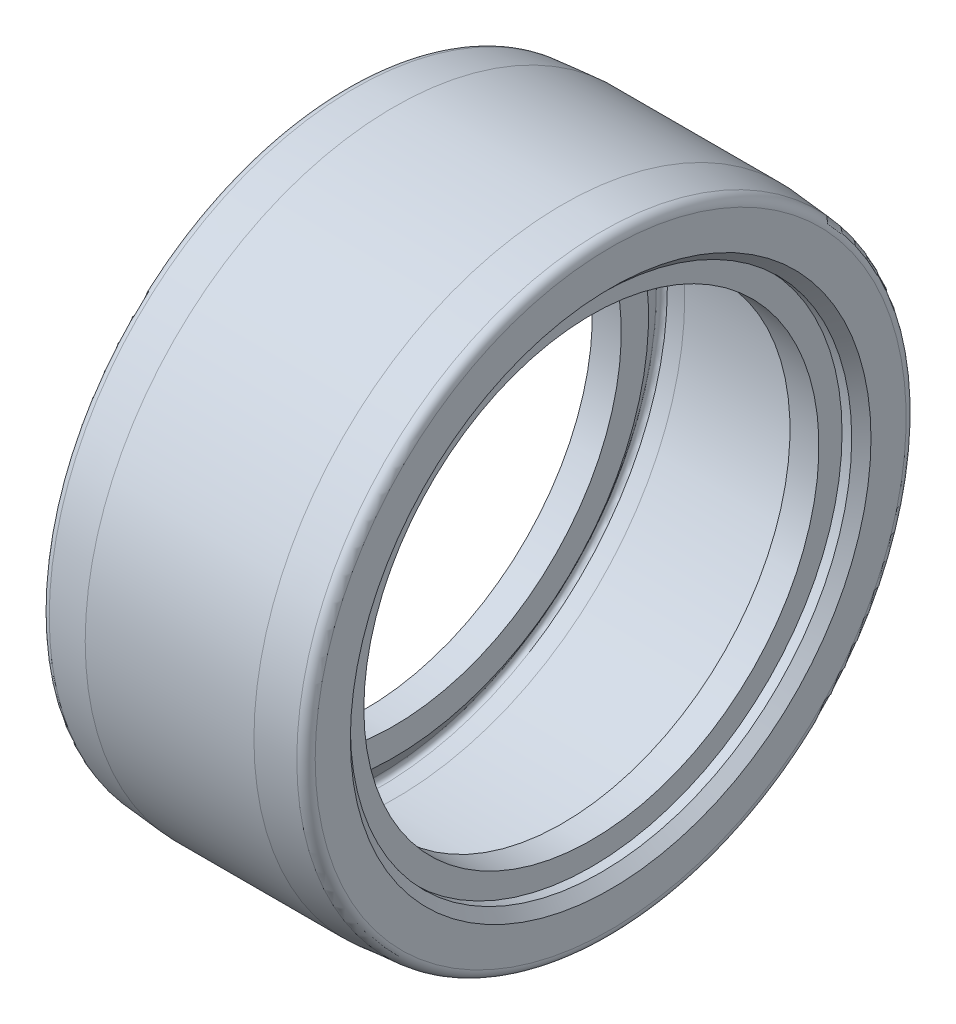
ISO-10303-21;
HEADER;
FILE_DESCRIPTION(('STEP AP214'),'2;1');
FILE_NAME('part.step','',(''),(''),'','','');
FILE_SCHEMA(('AUTOMOTIVE_DESIGN { 1 0 10303 214 1 1 1 1 }'));
ENDSEC;
DATA;
#1=APPLICATION_CONTEXT('core data for automotive mechanical design processes');
#2=APPLICATION_PROTOCOL_DEFINITION('international standard','automotive_design',2000,#1);
#3=PRODUCT_CONTEXT('',#1,'mechanical');
#4=PRODUCT('Part','Part','',(#3));
#5=PRODUCT_RELATED_PRODUCT_CATEGORY('part','',(#4));
#6=PRODUCT_DEFINITION_FORMATION('','',#4);
#7=PRODUCT_DEFINITION_CONTEXT('part definition',#1,'design');
#8=PRODUCT_DEFINITION('design','',#6,#7);
#9=PRODUCT_DEFINITION_SHAPE('','',#8);
#10=(LENGTH_UNIT() NAMED_UNIT(*) SI_UNIT(.MILLI.,.METRE.));
#11=(NAMED_UNIT(*) PLANE_ANGLE_UNIT() SI_UNIT($,.RADIAN.));
#12=(NAMED_UNIT(*) SI_UNIT($,.STERADIAN.) SOLID_ANGLE_UNIT());
#13=UNCERTAINTY_MEASURE_WITH_UNIT(LENGTH_MEASURE(1.E-05),#10,'distance_accuracy_value','');
#14=(GEOMETRIC_REPRESENTATION_CONTEXT(3) GLOBAL_UNCERTAINTY_ASSIGNED_CONTEXT((#13)) GLOBAL_UNIT_ASSIGNED_CONTEXT((#10,
#11,#12)) REPRESENTATION_CONTEXT('',''));
#15=CARTESIAN_POINT('',(0.,0.,0.));
#16=DIRECTION('',(0.,0.,1.));
#17=DIRECTION('',(1.,0.,0.));
#18=AXIS2_PLACEMENT_3D('',#15,#16,#17);
#19=CARTESIAN_POINT('',(2.5,23.6,0.));
#20=DIRECTION('',(-1.,0.,0.));
#21=DIRECTION('',(0.,0.,1.));
#22=AXIS2_PLACEMENT_3D('',#19,#20,#21);
#23=PLANE('',#22);
#24=CARTESIAN_POINT('',(2.5,0.,0.));
#25=DIRECTION('',(-1.,0.,0.));
#26=DIRECTION('',(0.,0.,1.));
#27=AXIS2_PLACEMENT_3D('',#24,#25,#26);
#28=CIRCLE('',#27,26.4296299831447);
#29=CARTESIAN_POINT('',(2.5,0.,26.4296299831447));
#30=VERTEX_POINT('',#29);
#31=EDGE_CURVE('E10',#30,#30,#28,.T.);
#32=ORIENTED_EDGE('',*,*,#31,.F.);
#33=EDGE_LOOP('',(#32));
#34=FACE_BOUND('',#33,.T.);
#35=CARTESIAN_POINT('',(2.5,0.,0.));
#36=DIRECTION('',(-1.,0.,0.));
#37=DIRECTION('',(0.,0.,1.));
#38=AXIS2_PLACEMENT_3D('',#35,#36,#37);
#39=CIRCLE('',#38,23.6);
#40=CARTESIAN_POINT('',(2.5,0.,23.6));
#41=VERTEX_POINT('',#40);
#42=EDGE_CURVE('E104',#41,#41,#39,.T.);
#43=ORIENTED_EDGE('',*,*,#42,.T.);
#44=EDGE_LOOP('',(#43));
#45=FACE_BOUND('',#44,.T.);
#46=ADVANCED_FACE('F28',(#34,#45),#23,.F.);
#47=CARTESIAN_POINT('',(2.5,0.,0.));
#48=DIRECTION('',(-1.,0.,0.));
#49=DIRECTION('',(0.,0.,1.));
#50=AXIS2_PLACEMENT_3D('',#47,#48,#49);
#51=CONICAL_SURFACE('',#50,26.4296299831447,0.959931088596876);
#52=CARTESIAN_POINT('',(0.646082422831486,0.,0.));
#53=DIRECTION('',(-1.,0.,0.));
#54=DIRECTION('',(0.,0.,1.));
#55=AXIS2_PLACEMENT_3D('',#52,#53,#54);
#56=CIRCLE('',#55,29.0772986756421);
#57=CARTESIAN_POINT('',(0.646082422831486,0.,29.0772986756421));
#58=VERTEX_POINT('',#57);
#59=EDGE_CURVE('E34',#58,#58,#56,.T.);
#60=ORIENTED_EDGE('',*,*,#59,.F.);
#61=EDGE_LOOP('',(#60));
#62=FACE_BOUND('',#61,.T.);
#63=ORIENTED_EDGE('',*,*,#31,.T.);
#64=EDGE_LOOP('',(#63));
#65=FACE_BOUND('',#64,.T.);
#66=ADVANCED_FACE('F237',(#62,#65),#51,.T.);
#67=CARTESIAN_POINT('',(1.05565844497598,0.,0.));
#68=DIRECTION('',(-1.,0.,0.));
#69=DIRECTION('',(0.,0.,1.));
#70=AXIS2_PLACEMENT_3D('',#67,#68,#69);
#71=TOROIDAL_SURFACE('',#70,29.3640868938176,0.5);
#72=CARTESIAN_POINT('',(1.01208057360216,0.,0.));
#73=DIRECTION('',(-1.,0.,0.));
#74=DIRECTION('',(0.,0.,1.));
#75=AXIS2_PLACEMENT_3D('',#72,#73,#74);
#76=CIRCLE('',#75,29.8621842428635);
#77=CARTESIAN_POINT('',(1.01208057360216,0.,29.8621842428635));
#78=VERTEX_POINT('',#77);
#79=EDGE_CURVE('E38',#78,#78,#76,.T.);
#80=ORIENTED_EDGE('',*,*,#79,.F.);
#81=EDGE_LOOP('',(#80));
#82=FACE_BOUND('',#81,.T.);
#83=ORIENTED_EDGE('',*,*,#59,.T.);
#84=EDGE_LOOP('',(#83));
#85=FACE_BOUND('',#84,.T.);
#86=ADVANCED_FACE('F232',(#82,#85),#71,.F.);
#87=CARTESIAN_POINT('',(1.01208057360216,0.,0.));
#88=DIRECTION('',(1.,0.,0.));
#89=DIRECTION('',(0.,0.,-1.));
#90=AXIS2_PLACEMENT_3D('',#87,#88,#89);
#91=CONICAL_SURFACE('',#90,29.8621842428635,0.0872664625997093);
#92=CARTESIAN_POINT('',(2.6743114854953,0.,0.));
#93=DIRECTION('',(-1.,0.,0.));
#94=DIRECTION('',(0.,0.,1.));
#95=AXIS2_PLACEMENT_3D('',#92,#93,#94);
#96=CIRCLE('',#95,30.0076106038165);
#97=CARTESIAN_POINT('',(2.6743114854953,0.,30.0076106038165));
#98=VERTEX_POINT('',#97);
#99=EDGE_CURVE('E42',#98,#98,#96,.T.);
#100=ORIENTED_EDGE('',*,*,#99,.F.);
#101=EDGE_LOOP('',(#100));
#102=FACE_BOUND('',#101,.T.);
#103=ORIENTED_EDGE('',*,*,#79,.T.);
#104=EDGE_LOOP('',(#103));
#105=FACE_BOUND('',#104,.T.);
#106=ADVANCED_FACE('F226',(#102,#105),#91,.F.);
#107=CARTESIAN_POINT('',(10.,0.,0.));
#108=DIRECTION('',(-1.,0.,0.));
#109=DIRECTION('',(0.,0.,1.));
#110=AXIS2_PLACEMENT_3D('',#107,#108,#109);
#111=CYLINDRICAL_SURFACE('',#110,30.0076106038165);
#112=CARTESIAN_POINT('',(19.8256885145047,0.,0.));
#113=DIRECTION('',(-1.,0.,0.));
#114=DIRECTION('',(0.,0.,1.));
#115=AXIS2_PLACEMENT_3D('',#112,#113,#114);
#116=CIRCLE('',#115,30.0076106038165);
#117=CARTESIAN_POINT('',(19.8256885145047,0.,30.0076106038165));
#118=VERTEX_POINT('',#117);
#119=EDGE_CURVE('E47',#118,#118,#116,.T.);
#120=ORIENTED_EDGE('',*,*,#119,.F.);
#121=EDGE_LOOP('',(#120));
#122=FACE_BOUND('',#121,.T.);
#123=ORIENTED_EDGE('',*,*,#99,.T.);
#124=EDGE_LOOP('',(#123));
#125=FACE_BOUND('',#124,.T.);
#126=ADVANCED_FACE('F220',(#122,#125),#111,.F.);
#127=CARTESIAN_POINT('',(19.8256885145047,0.,0.));
#128=DIRECTION('',(-1.,0.,0.));
#129=DIRECTION('',(0.,0.,1.));
#130=AXIS2_PLACEMENT_3D('',#127,#128,#129);
#131=CONICAL_SURFACE('',#130,30.0076106038165,0.0872664625997073);
#132=CARTESIAN_POINT('',(21.4879194263978,0.,0.));
#133=DIRECTION('',(-1.,0.,0.));
#134=DIRECTION('',(0.,0.,1.));
#135=AXIS2_PLACEMENT_3D('',#132,#133,#134);
#136=CIRCLE('',#135,29.8621842428635);
#137=CARTESIAN_POINT('',(21.4879194263978,0.,29.8621842428635));
#138=VERTEX_POINT('',#137);
#139=EDGE_CURVE('E50',#138,#138,#136,.T.);
#140=ORIENTED_EDGE('',*,*,#139,.F.);
#141=EDGE_LOOP('',(#140));
#142=FACE_BOUND('',#141,.T.);
#143=ORIENTED_EDGE('',*,*,#119,.T.);
#144=EDGE_LOOP('',(#143));
#145=FACE_BOUND('',#144,.T.);
#146=ADVANCED_FACE('F214',(#142,#145),#131,.F.);
#147=CARTESIAN_POINT('',(21.444341555024,0.,0.));
#148=DIRECTION('',(-1.,0.,0.));
#149=DIRECTION('',(0.,0.,1.));
#150=AXIS2_PLACEMENT_3D('',#147,#148,#149);
#151=TOROIDAL_SURFACE('',#150,29.3640868938176,0.500000000000002);
#152=CARTESIAN_POINT('',(21.8539175771685,0.,0.));
#153=DIRECTION('',(-1.,0.,0.));
#154=DIRECTION('',(0.,0.,1.));
#155=AXIS2_PLACEMENT_3D('',#152,#153,#154);
#156=CIRCLE('',#155,29.0772986756421);
#157=CARTESIAN_POINT('',(21.8539175771685,0.,29.0772986756421));
#158=VERTEX_POINT('',#157);
#159=EDGE_CURVE('E53',#158,#158,#156,.T.);
#160=ORIENTED_EDGE('',*,*,#159,.F.);
#161=EDGE_LOOP('',(#160));
#162=FACE_BOUND('',#161,.T.);
#163=ORIENTED_EDGE('',*,*,#139,.T.);
#164=EDGE_LOOP('',(#163));
#165=FACE_BOUND('',#164,.T.);
#166=ADVANCED_FACE('F208',(#162,#165),#151,.F.);
#167=CARTESIAN_POINT('',(21.8539175771685,0.,0.));
#168=DIRECTION('',(1.,0.,0.));
#169=DIRECTION('',(0.,0.,-1.));
#170=AXIS2_PLACEMENT_3D('',#167,#168,#169);
#171=CONICAL_SURFACE('',#170,29.0772986756421,0.959931088596874);
#172=CARTESIAN_POINT('',(20.,0.,0.));
#173=DIRECTION('',(-1.,0.,0.));
#174=DIRECTION('',(0.,0.,1.));
#175=AXIS2_PLACEMENT_3D('',#172,#173,#174);
#176=CIRCLE('',#175,26.4296299831448);
#177=CARTESIAN_POINT('',(20.,0.,26.4296299831448));
#178=VERTEX_POINT('',#177);
#179=EDGE_CURVE('E56',#178,#178,#176,.T.);
#180=ORIENTED_EDGE('',*,*,#179,.F.);
#181=EDGE_LOOP('',(#180));
#182=FACE_BOUND('',#181,.T.);
#183=ORIENTED_EDGE('',*,*,#159,.T.);
#184=EDGE_LOOP('',(#183));
#185=FACE_BOUND('',#184,.T.);
#186=ADVANCED_FACE('F202',(#182,#185),#171,.T.);
#187=CARTESIAN_POINT('',(20.,23.6,0.));
#188=DIRECTION('',(1.,0.,0.));
#189=DIRECTION('',(0.,0.,-1.));
#190=AXIS2_PLACEMENT_3D('',#187,#188,#189);
#191=PLANE('',#190);
#192=CARTESIAN_POINT('',(20.,0.,0.));
#193=DIRECTION('',(-1.,0.,0.));
#194=DIRECTION('',(0.,0.,1.));
#195=AXIS2_PLACEMENT_3D('',#192,#193,#194);
#196=CIRCLE('',#195,23.6);
#197=CARTESIAN_POINT('',(20.,0.,23.6));
#198=VERTEX_POINT('',#197);
#199=EDGE_CURVE('E59',#198,#198,#196,.T.);
#200=ORIENTED_EDGE('',*,*,#199,.F.);
#201=EDGE_LOOP('',(#200));
#202=FACE_BOUND('',#201,.T.);
#203=ORIENTED_EDGE('',*,*,#179,.T.);
#204=EDGE_LOOP('',(#203));
#205=FACE_BOUND('',#204,.T.);
#206=ADVANCED_FACE('F196',(#202,#205),#191,.F.);
#207=CARTESIAN_POINT('',(10.,0.,0.));
#208=DIRECTION('',(-1.,0.,0.));
#209=DIRECTION('',(0.,0.,1.));
#210=AXIS2_PLACEMENT_3D('',#207,#208,#209);
#211=CYLINDRICAL_SURFACE('',#210,23.6);
#212=CARTESIAN_POINT('',(23.,0.,0.));
#213=DIRECTION('',(-1.,0.,0.));
#214=DIRECTION('',(0.,0.,1.));
#215=AXIS2_PLACEMENT_3D('',#212,#213,#214);
#216=CIRCLE('',#215,23.6);
#217=CARTESIAN_POINT('',(23.,0.,23.6));
#218=VERTEX_POINT('',#217);
#219=EDGE_CURVE('E62',#218,#218,#216,.T.);
#220=ORIENTED_EDGE('',*,*,#219,.F.);
#221=EDGE_LOOP('',(#220));
#222=FACE_BOUND('',#221,.T.);
#223=ORIENTED_EDGE('',*,*,#199,.T.);
#224=EDGE_LOOP('',(#223));
#225=FACE_BOUND('',#224,.T.);
#226=ADVANCED_FACE('F190',(#222,#225),#211,.F.);
#227=CARTESIAN_POINT('',(23.,23.6,0.));
#228=DIRECTION('',(-1.,0.,0.));
#229=DIRECTION('',(0.,0.,1.));
#230=AXIS2_PLACEMENT_3D('',#227,#228,#229);
#231=PLANE('',#230);
#232=CARTESIAN_POINT('',(23.,0.,0.));
#233=DIRECTION('',(-1.,0.,0.));
#234=DIRECTION('',(0.,0.,1.));
#235=AXIS2_PLACEMENT_3D('',#232,#233,#234);
#236=CIRCLE('',#235,26.);
#237=CARTESIAN_POINT('',(23.,0.,26.));
#238=VERTEX_POINT('',#237);
#239=EDGE_CURVE('E65',#238,#238,#236,.T.);
#240=ORIENTED_EDGE('',*,*,#239,.F.);
#241=EDGE_LOOP('',(#240));
#242=FACE_BOUND('',#241,.T.);
#243=ORIENTED_EDGE('',*,*,#219,.T.);
#244=EDGE_LOOP('',(#243));
#245=FACE_BOUND('',#244,.T.);
#246=ADVANCED_FACE('F184',(#242,#245),#231,.F.);
#247=CARTESIAN_POINT('',(10.,0.,0.));
#248=DIRECTION('',(-1.,0.,0.));
#249=DIRECTION('',(0.,0.,1.));
#250=AXIS2_PLACEMENT_3D('',#247,#248,#249);
#251=CYLINDRICAL_SURFACE('',#250,26.);
#252=CARTESIAN_POINT('',(24.,0.,0.));
#253=DIRECTION('',(-1.,0.,0.));
#254=DIRECTION('',(0.,0.,1.));
#255=AXIS2_PLACEMENT_3D('',#252,#253,#254);
#256=CIRCLE('',#255,26.);
#257=CARTESIAN_POINT('',(24.,0.,26.));
#258=VERTEX_POINT('',#257);
#259=EDGE_CURVE('E68',#258,#258,#256,.T.);
#260=ORIENTED_EDGE('',*,*,#259,.F.);
#261=EDGE_LOOP('',(#260));
#262=FACE_BOUND('',#261,.T.);
#263=ORIENTED_EDGE('',*,*,#239,.T.);
#264=EDGE_LOOP('',(#263));
#265=FACE_BOUND('',#264,.T.);
#266=ADVANCED_FACE('F178',(#262,#265),#251,.F.);
#267=CARTESIAN_POINT('',(24.,0.,0.));
#268=DIRECTION('',(1.,0.,0.));
#269=DIRECTION('',(0.,0.,-1.));
#270=AXIS2_PLACEMENT_3D('',#267,#268,#269);
#271=CONICAL_SURFACE('',#270,26.,0.785398163397448);
#272=CARTESIAN_POINT('',(25.,0.,0.));
#273=DIRECTION('',(-1.,0.,0.));
#274=DIRECTION('',(0.,0.,1.));
#275=AXIS2_PLACEMENT_3D('',#272,#273,#274);
#276=CIRCLE('',#275,27.);
#277=CARTESIAN_POINT('',(25.,0.,27.));
#278=VERTEX_POINT('',#277);
#279=EDGE_CURVE('E71',#278,#278,#276,.T.);
#280=ORIENTED_EDGE('',*,*,#279,.F.);
#281=EDGE_LOOP('',(#280));
#282=FACE_BOUND('',#281,.T.);
#283=ORIENTED_EDGE('',*,*,#259,.T.);
#284=EDGE_LOOP('',(#283));
#285=FACE_BOUND('',#284,.T.);
#286=ADVANCED_FACE('F172',(#282,#285),#271,.F.);
#287=CARTESIAN_POINT('',(25.,30.646225508353,0.));
#288=DIRECTION('',(-1.,0.,0.));
#289=DIRECTION('',(0.,0.,1.));
#290=AXIS2_PLACEMENT_3D('',#287,#288,#289);
#291=PLANE('',#290);
#292=CARTESIAN_POINT('',(25.,0.,0.));
#293=DIRECTION('',(-1.,0.,0.));
#294=DIRECTION('',(0.,0.,1.));
#295=AXIS2_PLACEMENT_3D('',#292,#293,#294);
#296=CIRCLE('',#295,30.646225508353);
#297=CARTESIAN_POINT('',(25.,0.,30.646225508353));
#298=VERTEX_POINT('',#297);
#299=EDGE_CURVE('E74',#298,#298,#296,.T.);
#300=ORIENTED_EDGE('',*,*,#299,.F.);
#301=EDGE_LOOP('',(#300));
#302=FACE_BOUND('',#301,.T.);
#303=ORIENTED_EDGE('',*,*,#279,.T.);
#304=EDGE_LOOP('',(#303));
#305=FACE_BOUND('',#304,.T.);
#306=ADVANCED_FACE('F166',(#302,#305),#291,.F.);
#307=CARTESIAN_POINT('',(24.,0.,0.));
#308=DIRECTION('',(-1.,0.,0.));
#309=DIRECTION('',(0.,0.,1.));
#310=AXIS2_PLACEMENT_3D('',#307,#308,#309);
#311=TOROIDAL_SURFACE('',#310,30.646225508353,1.);
#312=CARTESIAN_POINT('',(24.0871557427476,0.,0.));
#313=DIRECTION('',(-1.,0.,0.));
#314=DIRECTION('',(0.,0.,1.));
#315=AXIS2_PLACEMENT_3D('',#312,#313,#314);
#316=CIRCLE('',#315,31.6424202064447);
#317=CARTESIAN_POINT('',(24.0871557427476,0.,31.6424202064447));
#318=VERTEX_POINT('',#317);
#319=EDGE_CURVE('E77',#318,#318,#316,.T.);
#320=ORIENTED_EDGE('',*,*,#319,.F.);
#321=EDGE_LOOP('',(#320));
#322=FACE_BOUND('',#321,.T.);
#323=ORIENTED_EDGE('',*,*,#299,.T.);
#324=EDGE_LOOP('',(#323));
#325=FACE_BOUND('',#324,.T.);
#326=ADVANCED_FACE('F160',(#322,#325),#311,.T.);
#327=CARTESIAN_POINT('',(24.0871557427476,0.,0.));
#328=DIRECTION('',(-1.,0.,0.));
#329=DIRECTION('',(0.,0.,1.));
#330=AXIS2_PLACEMENT_3D('',#327,#328,#329);
#331=CONICAL_SURFACE('',#330,31.6424202064447,0.0872664625997093);
#332=CARTESIAN_POINT('',(20.,0.,0.));
#333=DIRECTION('',(-1.,0.,0.));
#334=DIRECTION('',(0.,0.,1.));
#335=AXIS2_PLACEMENT_3D('',#332,#333,#334);
#336=CIRCLE('',#335,32.);
#337=CARTESIAN_POINT('',(20.,0.,32.));
#338=VERTEX_POINT('',#337);
#339=EDGE_CURVE('E80',#338,#338,#336,.T.);
#340=ORIENTED_EDGE('',*,*,#339,.F.);
#341=EDGE_LOOP('',(#340));
#342=FACE_BOUND('',#341,.T.);
#343=ORIENTED_EDGE('',*,*,#319,.T.);
#344=EDGE_LOOP('',(#343));
#345=FACE_BOUND('',#344,.T.);
#346=ADVANCED_FACE('F154',(#342,#345),#331,.T.);
#347=CARTESIAN_POINT('',(10.,0.,0.));
#348=DIRECTION('',(-1.,0.,0.));
#349=DIRECTION('',(0.,0.,1.));
#350=AXIS2_PLACEMENT_3D('',#347,#348,#349);
#351=CYLINDRICAL_SURFACE('',#350,32.);
#352=CARTESIAN_POINT('',(2.5,0.,0.));
#353=DIRECTION('',(-1.,0.,0.));
#354=DIRECTION('',(0.,0.,1.));
#355=AXIS2_PLACEMENT_3D('',#352,#353,#354);
#356=CIRCLE('',#355,32.);
#357=CARTESIAN_POINT('',(2.5,0.,32.));
#358=VERTEX_POINT('',#357);
#359=EDGE_CURVE('E83',#358,#358,#356,.T.);
#360=ORIENTED_EDGE('',*,*,#359,.F.);
#361=EDGE_LOOP('',(#360));
#362=FACE_BOUND('',#361,.T.);
#363=ORIENTED_EDGE('',*,*,#339,.T.);
#364=EDGE_LOOP('',(#363));
#365=FACE_BOUND('',#364,.T.);
#366=ADVANCED_FACE('F148',(#362,#365),#351,.T.);
#367=CARTESIAN_POINT('',(2.5,0.,0.));
#368=DIRECTION('',(1.,0.,0.));
#369=DIRECTION('',(0.,0.,-1.));
#370=AXIS2_PLACEMENT_3D('',#367,#368,#369);
#371=CONICAL_SURFACE('',#370,32.,0.0872664625997092);
#372=CARTESIAN_POINT('',(-1.58715574274764,0.,0.));
#373=DIRECTION('',(-1.,0.,0.));
#374=DIRECTION('',(0.,0.,1.));
#375=AXIS2_PLACEMENT_3D('',#372,#373,#374);
#376=CIRCLE('',#375,31.6424202064447);
#377=CARTESIAN_POINT('',(-1.58715574274764,0.,31.6424202064447));
#378=VERTEX_POINT('',#377);
#379=EDGE_CURVE('E86',#378,#378,#376,.T.);
#380=ORIENTED_EDGE('',*,*,#379,.F.);
#381=EDGE_LOOP('',(#380));
#382=FACE_BOUND('',#381,.T.);
#383=ORIENTED_EDGE('',*,*,#359,.T.);
#384=EDGE_LOOP('',(#383));
#385=FACE_BOUND('',#384,.T.);
#386=ADVANCED_FACE('F142',(#382,#385),#371,.T.);
#387=CARTESIAN_POINT('',(-1.5,0.,0.));
#388=DIRECTION('',(-1.,0.,0.));
#389=DIRECTION('',(0.,0.,1.));
#390=AXIS2_PLACEMENT_3D('',#387,#388,#389);
#391=TOROIDAL_SURFACE('',#390,30.646225508353,1.);
#392=CARTESIAN_POINT('',(-2.5,0.,0.));
#393=DIRECTION('',(-1.,0.,0.));
#394=DIRECTION('',(0.,0.,1.));
#395=AXIS2_PLACEMENT_3D('',#392,#393,#394);
#396=CIRCLE('',#395,30.646225508353);
#397=CARTESIAN_POINT('',(-2.5,0.,30.646225508353));
#398=VERTEX_POINT('',#397);
#399=EDGE_CURVE('E89',#398,#398,#396,.T.);
#400=ORIENTED_EDGE('',*,*,#399,.F.);
#401=EDGE_LOOP('',(#400));
#402=FACE_BOUND('',#401,.T.);
#403=ORIENTED_EDGE('',*,*,#379,.T.);
#404=EDGE_LOOP('',(#403));
#405=FACE_BOUND('',#404,.T.);
#406=ADVANCED_FACE('F136',(#402,#405),#391,.T.);
#407=CARTESIAN_POINT('',(-2.5,30.646225508353,0.));
#408=DIRECTION('',(1.,0.,0.));
#409=DIRECTION('',(0.,0.,-1.));
#410=AXIS2_PLACEMENT_3D('',#407,#408,#409);
#411=PLANE('',#410);
#412=CARTESIAN_POINT('',(-2.5,0.,0.));
#413=DIRECTION('',(-1.,0.,0.));
#414=DIRECTION('',(0.,0.,1.));
#415=AXIS2_PLACEMENT_3D('',#412,#413,#414);
#416=CIRCLE('',#415,27.);
#417=CARTESIAN_POINT('',(-2.5,0.,27.));
#418=VERTEX_POINT('',#417);
#419=EDGE_CURVE('E92',#418,#418,#416,.T.);
#420=ORIENTED_EDGE('',*,*,#419,.F.);
#421=EDGE_LOOP('',(#420));
#422=FACE_BOUND('',#421,.T.);
#423=ORIENTED_EDGE('',*,*,#399,.T.);
#424=EDGE_LOOP('',(#423));
#425=FACE_BOUND('',#424,.T.);
#426=ADVANCED_FACE('F130',(#422,#425),#411,.F.);
#427=CARTESIAN_POINT('',(-2.5,0.,0.));
#428=DIRECTION('',(-1.,0.,0.));
#429=DIRECTION('',(0.,0.,1.));
#430=AXIS2_PLACEMENT_3D('',#427,#428,#429);
#431=CONICAL_SURFACE('',#430,27.,0.785398163397449);
#432=CARTESIAN_POINT('',(-1.5,0.,0.));
#433=DIRECTION('',(-1.,0.,0.));
#434=DIRECTION('',(0.,0.,1.));
#435=AXIS2_PLACEMENT_3D('',#432,#433,#434);
#436=CIRCLE('',#435,26.);
#437=CARTESIAN_POINT('',(-1.5,0.,26.));
#438=VERTEX_POINT('',#437);
#439=EDGE_CURVE('E95',#438,#438,#436,.T.);
#440=ORIENTED_EDGE('',*,*,#439,.F.);
#441=EDGE_LOOP('',(#440));
#442=FACE_BOUND('',#441,.T.);
#443=ORIENTED_EDGE('',*,*,#419,.T.);
#444=EDGE_LOOP('',(#443));
#445=FACE_BOUND('',#444,.T.);
#446=ADVANCED_FACE('F124',(#442,#445),#431,.F.);
#447=CARTESIAN_POINT('',(10.,0.,0.));
#448=DIRECTION('',(-1.,0.,0.));
#449=DIRECTION('',(0.,0.,1.));
#450=AXIS2_PLACEMENT_3D('',#447,#448,#449);
#451=CYLINDRICAL_SURFACE('',#450,26.);
#452=CARTESIAN_POINT('',(-0.5,0.,0.));
#453=DIRECTION('',(-1.,0.,0.));
#454=DIRECTION('',(0.,0.,1.));
#455=AXIS2_PLACEMENT_3D('',#452,#453,#454);
#456=CIRCLE('',#455,26.);
#457=CARTESIAN_POINT('',(-0.5,0.,26.));
#458=VERTEX_POINT('',#457);
#459=EDGE_CURVE('E98',#458,#458,#456,.T.);
#460=ORIENTED_EDGE('',*,*,#459,.F.);
#461=EDGE_LOOP('',(#460));
#462=FACE_BOUND('',#461,.T.);
#463=ORIENTED_EDGE('',*,*,#439,.T.);
#464=EDGE_LOOP('',(#463));
#465=FACE_BOUND('',#464,.T.);
#466=ADVANCED_FACE('F118',(#462,#465),#451,.F.);
#467=CARTESIAN_POINT('',(-0.500000000000001,23.6,0.));
#468=DIRECTION('',(1.,0.,0.));
#469=DIRECTION('',(0.,0.,-1.));
#470=AXIS2_PLACEMENT_3D('',#467,#468,#469);
#471=PLANE('',#470);
#472=CARTESIAN_POINT('',(-0.5,0.,0.));
#473=DIRECTION('',(-1.,0.,0.));
#474=DIRECTION('',(0.,0.,1.));
#475=AXIS2_PLACEMENT_3D('',#472,#473,#474);
#476=CIRCLE('',#475,23.6);
#477=CARTESIAN_POINT('',(-0.5,0.,23.6));
#478=VERTEX_POINT('',#477);
#479=EDGE_CURVE('E101',#478,#478,#476,.T.);
#480=ORIENTED_EDGE('',*,*,#479,.F.);
#481=EDGE_LOOP('',(#480));
#482=FACE_BOUND('',#481,.T.);
#483=ORIENTED_EDGE('',*,*,#459,.T.);
#484=EDGE_LOOP('',(#483));
#485=FACE_BOUND('',#484,.T.);
#486=ADVANCED_FACE('F112',(#482,#485),#471,.F.);
#487=CARTESIAN_POINT('',(10.,0.,0.));
#488=DIRECTION('',(-1.,0.,0.));
#489=DIRECTION('',(0.,0.,1.));
#490=AXIS2_PLACEMENT_3D('',#487,#488,#489);
#491=CYLINDRICAL_SURFACE('',#490,23.6);
#492=ORIENTED_EDGE('',*,*,#42,.F.);
#493=EDGE_LOOP('',(#492));
#494=FACE_BOUND('',#493,.T.);
#495=ORIENTED_EDGE('',*,*,#479,.T.);
#496=EDGE_LOOP('',(#495));
#497=FACE_BOUND('',#496,.T.);
#498=ADVANCED_FACE('F109',(#494,#497),#491,.F.);
#499=CLOSED_SHELL('',(#46,#66,#86,#106,#126,#146,#166,#186,#206,#226,#246,#266,#286,#306,#326,
#346,#366,#386,#406,#426,#446,#466,#486,#498));
#500=MANIFOLD_SOLID_BREP('B2',#499);
#501=ADVANCED_BREP_SHAPE_REPRESENTATION('',(#18,#500),#14);
#502=SHAPE_DEFINITION_REPRESENTATION(#9,#501);
ENDSEC;
END-ISO-10303-21;
